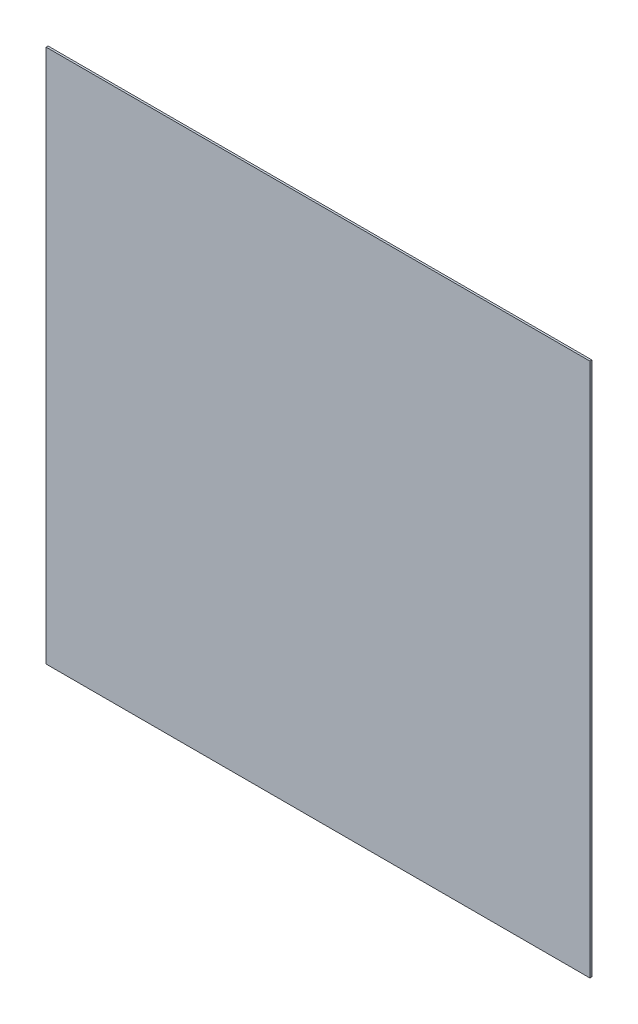
ISO-10303-21;
HEADER;
FILE_DESCRIPTION(('STEP AP214'),'2;1');
FILE_NAME('part.step','',(''),(''),'','','');
FILE_SCHEMA(('AUTOMOTIVE_DESIGN { 1 0 10303 214 1 1 1 1 }'));
ENDSEC;
DATA;
#1=APPLICATION_CONTEXT('core data for automotive mechanical design processes');
#2=APPLICATION_PROTOCOL_DEFINITION('international standard','automotive_design',2000,#1);
#3=PRODUCT_CONTEXT('',#1,'mechanical');
#4=PRODUCT('Part','Part','',(#3));
#5=PRODUCT_RELATED_PRODUCT_CATEGORY('part','',(#4));
#6=PRODUCT_DEFINITION_FORMATION('','',#4);
#7=PRODUCT_DEFINITION_CONTEXT('part definition',#1,'design');
#8=PRODUCT_DEFINITION('design','',#6,#7);
#9=PRODUCT_DEFINITION_SHAPE('','',#8);
#10=(LENGTH_UNIT() NAMED_UNIT(*) SI_UNIT(.MILLI.,.METRE.));
#11=(NAMED_UNIT(*) PLANE_ANGLE_UNIT() SI_UNIT($,.RADIAN.));
#12=(NAMED_UNIT(*) SI_UNIT($,.STERADIAN.) SOLID_ANGLE_UNIT());
#13=UNCERTAINTY_MEASURE_WITH_UNIT(LENGTH_MEASURE(1.E-05),#10,'distance_accuracy_value','');
#14=(GEOMETRIC_REPRESENTATION_CONTEXT(3) GLOBAL_UNCERTAINTY_ASSIGNED_CONTEXT((#13)) GLOBAL_UNIT_ASSIGNED_CONTEXT((#10,
#11,#12)) REPRESENTATION_CONTEXT('',''));
#15=CARTESIAN_POINT('',(0.,0.,0.));
#16=DIRECTION('',(0.,0.,1.));
#17=DIRECTION('',(1.,0.,0.));
#18=AXIS2_PLACEMENT_3D('',#15,#16,#17);
#19=CARTESIAN_POINT('',(-274.240625,-269.478125,2.));
#20=DIRECTION('',(1.,0.,0.));
#21=DIRECTION('',(0.,0.,-1.));
#22=AXIS2_PLACEMENT_3D('',#19,#20,#21);
#23=PLANE('',#22);
#24=DIRECTION('',(0.,-1.,0.));
#25=VECTOR('',#24,1.);
#26=CARTESIAN_POINT('',(-274.240625,-269.478125,0.));
#27=LINE('',#26,#25);
#28=CARTESIAN_POINT('',(-274.240625,269.478125,0.));
#29=VERTEX_POINT('',#28);
#30=CARTESIAN_POINT('',(-274.240625,-269.478125,0.));
#31=VERTEX_POINT('',#30);
#32=EDGE_CURVE('E113',#29,#31,#27,.T.);
#33=ORIENTED_EDGE('',*,*,#32,.T.);
#34=DIRECTION('',(0.,0.,-1.));
#35=VECTOR('',#34,1.);
#36=CARTESIAN_POINT('',(-274.240625,-269.478125,2.));
#37=LINE('',#36,#35);
#38=CARTESIAN_POINT('',(-274.240625,-269.478125,2.));
#39=VERTEX_POINT('',#38);
#40=EDGE_CURVE('E11',#39,#31,#37,.T.);
#41=ORIENTED_EDGE('',*,*,#40,.F.);
#42=DIRECTION('',(0.,-1.,0.));
#43=VECTOR('',#42,1.);
#44=CARTESIAN_POINT('',(-274.240625,-269.478125,2.));
#45=LINE('',#44,#43);
#46=CARTESIAN_POINT('',(-274.240625,269.478125,2.));
#47=VERTEX_POINT('',#46);
#48=EDGE_CURVE('E97',#47,#39,#45,.T.);
#49=ORIENTED_EDGE('',*,*,#48,.F.);
#50=DIRECTION('',(0.,0.,-1.));
#51=VECTOR('',#50,1.);
#52=CARTESIAN_POINT('',(-274.240625,269.478125,2.));
#53=LINE('',#52,#51);
#54=EDGE_CURVE('E109',#47,#29,#53,.T.);
#55=ORIENTED_EDGE('',*,*,#54,.T.);
#56=EDGE_LOOP('',(#33,#41,#49,#55));
#57=FACE_BOUND('',#56,.T.);
#58=ADVANCED_FACE('F45',(#57),#23,.F.);
#59=CARTESIAN_POINT('',(274.240625,-269.478125,2.));
#60=DIRECTION('',(0.,1.,0.));
#61=DIRECTION('',(-1.,0.,0.));
#62=AXIS2_PLACEMENT_3D('',#59,#60,#61);
#63=PLANE('',#62);
#64=DIRECTION('',(1.,0.,0.));
#65=VECTOR('',#64,1.);
#66=CARTESIAN_POINT('',(274.240625,-269.478125,0.));
#67=LINE('',#66,#65);
#68=CARTESIAN_POINT('',(274.240625,-269.478125,0.));
#69=VERTEX_POINT('',#68);
#70=EDGE_CURVE('E102',#31,#69,#67,.T.);
#71=ORIENTED_EDGE('',*,*,#70,.T.);
#72=DIRECTION('',(0.,0.,-1.));
#73=VECTOR('',#72,1.);
#74=CARTESIAN_POINT('',(274.240625,-269.478125,2.));
#75=LINE('',#74,#73);
#76=CARTESIAN_POINT('',(274.240625,-269.478125,2.));
#77=VERTEX_POINT('',#76);
#78=EDGE_CURVE('E54',#77,#69,#75,.T.);
#79=ORIENTED_EDGE('',*,*,#78,.F.);
#80=DIRECTION('',(1.,0.,0.));
#81=VECTOR('',#80,1.);
#82=CARTESIAN_POINT('',(274.240625,-269.478125,2.));
#83=LINE('',#82,#81);
#84=EDGE_CURVE('E92',#39,#77,#83,.T.);
#85=ORIENTED_EDGE('',*,*,#84,.F.);
#86=ORIENTED_EDGE('',*,*,#40,.T.);
#87=EDGE_LOOP('',(#71,#79,#85,#86));
#88=FACE_BOUND('',#87,.T.);
#89=ADVANCED_FACE('F101',(#88),#63,.F.);
#90=CARTESIAN_POINT('',(274.240625,-269.478125,2.));
#91=DIRECTION('',(-1.,0.,0.));
#92=DIRECTION('',(0.,0.,1.));
#93=AXIS2_PLACEMENT_3D('',#90,#91,#92);
#94=PLANE('',#93);
#95=DIRECTION('',(0.,1.,0.));
#96=VECTOR('',#95,1.);
#97=CARTESIAN_POINT('',(274.240625,-269.478125,0.));
#98=LINE('',#97,#96);
#99=CARTESIAN_POINT('',(274.240625,269.478125,0.));
#100=VERTEX_POINT('',#99);
#101=EDGE_CURVE('E79',#69,#100,#98,.T.);
#102=ORIENTED_EDGE('',*,*,#101,.T.);
#103=DIRECTION('',(0.,0.,-1.));
#104=VECTOR('',#103,1.);
#105=CARTESIAN_POINT('',(274.240625,269.478125,2.));
#106=LINE('',#105,#104);
#107=CARTESIAN_POINT('',(274.240625,269.478125,2.));
#108=VERTEX_POINT('',#107);
#109=EDGE_CURVE('E104',#108,#100,#106,.T.);
#110=ORIENTED_EDGE('',*,*,#109,.F.);
#111=DIRECTION('',(0.,1.,0.));
#112=VECTOR('',#111,1.);
#113=CARTESIAN_POINT('',(274.240625,-269.478125,2.));
#114=LINE('',#113,#112);
#115=EDGE_CURVE('E95',#77,#108,#114,.T.);
#116=ORIENTED_EDGE('',*,*,#115,.F.);
#117=ORIENTED_EDGE('',*,*,#78,.T.);
#118=EDGE_LOOP('',(#102,#110,#116,#117));
#119=FACE_BOUND('',#118,.T.);
#120=ADVANCED_FACE('F105',(#119),#94,.F.);
#121=CARTESIAN_POINT('',(274.240625,269.478125,2.));
#122=DIRECTION('',(0.,-1.,0.));
#123=DIRECTION('',(1.,0.,0.));
#124=AXIS2_PLACEMENT_3D('',#121,#122,#123);
#125=PLANE('',#124);
#126=DIRECTION('',(-1.,0.,0.));
#127=VECTOR('',#126,1.);
#128=CARTESIAN_POINT('',(274.240625,269.478125,0.));
#129=LINE('',#128,#127);
#130=EDGE_CURVE('E85',#100,#29,#129,.T.);
#131=ORIENTED_EDGE('',*,*,#130,.T.);
#132=ORIENTED_EDGE('',*,*,#54,.F.);
#133=DIRECTION('',(-1.,0.,0.));
#134=VECTOR('',#133,1.);
#135=CARTESIAN_POINT('',(274.240625,269.478125,2.));
#136=LINE('',#135,#134);
#137=EDGE_CURVE('E62',#108,#47,#136,.T.);
#138=ORIENTED_EDGE('',*,*,#137,.F.);
#139=ORIENTED_EDGE('',*,*,#109,.T.);
#140=EDGE_LOOP('',(#131,#132,#138,#139));
#141=FACE_BOUND('',#140,.T.);
#142=ADVANCED_FACE('F126',(#141),#125,.F.);
#143=CARTESIAN_POINT('',(0.,0.,2.));
#144=DIRECTION('',(0.,0.,1.));
#145=DIRECTION('',(1.,0.,0.));
#146=AXIS2_PLACEMENT_3D('',#143,#144,#145);
#147=PLANE('',#146);
#148=ORIENTED_EDGE('',*,*,#48,.T.);
#149=ORIENTED_EDGE('',*,*,#84,.T.);
#150=ORIENTED_EDGE('',*,*,#115,.T.);
#151=ORIENTED_EDGE('',*,*,#137,.T.);
#152=EDGE_LOOP('',(#148,#149,#150,#151));
#153=FACE_BOUND('',#152,.T.);
#154=ADVANCED_FACE('F93',(#153),#147,.T.);
#155=CARTESIAN_POINT('',(0.,0.,0.));
#156=DIRECTION('',(0.,0.,1.));
#157=DIRECTION('',(1.,0.,0.));
#158=AXIS2_PLACEMENT_3D('',#155,#156,#157);
#159=PLANE('',#158);
#160=ORIENTED_EDGE('',*,*,#32,.F.);
#161=ORIENTED_EDGE('',*,*,#130,.F.);
#162=ORIENTED_EDGE('',*,*,#101,.F.);
#163=ORIENTED_EDGE('',*,*,#70,.F.);
#164=EDGE_LOOP('',(#160,#161,#162,#163));
#165=FACE_BOUND('',#164,.T.);
#166=ADVANCED_FACE('F129',(#165),#159,.F.);
#167=CLOSED_SHELL('',(#58,#89,#120,#142,#154,#166));
#168=MANIFOLD_SOLID_BREP('B2',#167);
#169=ADVANCED_BREP_SHAPE_REPRESENTATION('',(#18,#168),#14);
#170=SHAPE_DEFINITION_REPRESENTATION(#9,#169);
ENDSEC;
END-ISO-10303-21;
